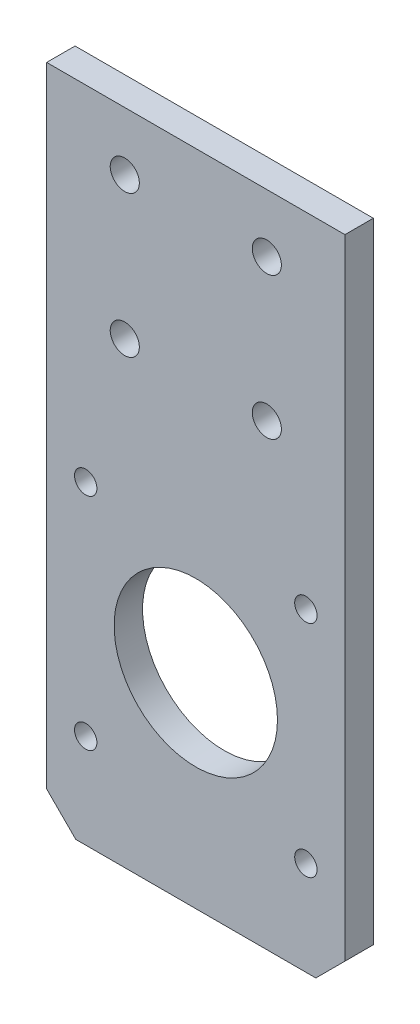
ISO-10303-21;
HEADER;
FILE_DESCRIPTION(('STEP AP214'),'2;1');
FILE_NAME('part.step','',(''),(''),'','','');
FILE_SCHEMA(('AUTOMOTIVE_DESIGN { 1 0 10303 214 1 1 1 1 }'));
ENDSEC;
DATA;
#1=APPLICATION_CONTEXT('core data for automotive mechanical design processes');
#2=APPLICATION_PROTOCOL_DEFINITION('international standard','automotive_design',2000,#1);
#3=PRODUCT_CONTEXT('',#1,'mechanical');
#4=PRODUCT('Part','Part','',(#3));
#5=PRODUCT_RELATED_PRODUCT_CATEGORY('part','',(#4));
#6=PRODUCT_DEFINITION_FORMATION('','',#4);
#7=PRODUCT_DEFINITION_CONTEXT('part definition',#1,'design');
#8=PRODUCT_DEFINITION('design','',#6,#7);
#9=PRODUCT_DEFINITION_SHAPE('','',#8);
#10=(LENGTH_UNIT() NAMED_UNIT(*) SI_UNIT(.MILLI.,.METRE.));
#11=(NAMED_UNIT(*) PLANE_ANGLE_UNIT() SI_UNIT($,.RADIAN.));
#12=(NAMED_UNIT(*) SI_UNIT($,.STERADIAN.) SOLID_ANGLE_UNIT());
#13=UNCERTAINTY_MEASURE_WITH_UNIT(LENGTH_MEASURE(1.E-05),#10,'distance_accuracy_value','');
#14=(GEOMETRIC_REPRESENTATION_CONTEXT(3) GLOBAL_UNCERTAINTY_ASSIGNED_CONTEXT((#13)) GLOBAL_UNIT_ASSIGNED_CONTEXT((#10,
#11,#12)) REPRESENTATION_CONTEXT('',''));
#15=CARTESIAN_POINT('',(0.,0.,0.));
#16=DIRECTION('',(0.,0.,1.));
#17=DIRECTION('',(1.,0.,0.));
#18=AXIS2_PLACEMENT_3D('',#15,#16,#17);
#19=CARTESIAN_POINT('',(0.,0.,4.));
#20=DIRECTION('',(0.,0.,1.));
#21=DIRECTION('',(1.,0.,0.));
#22=AXIS2_PLACEMENT_3D('',#19,#20,#21);
#23=PLANE('',#22);
#24=CARTESIAN_POINT('',(5.50000000000001,5.58,4.));
#25=DIRECTION('',(0.,0.,1.));
#26=DIRECTION('',(1.,0.,0.));
#27=AXIS2_PLACEMENT_3D('',#24,#25,#26);
#28=CIRCLE('',#27,1.575);
#29=CARTESIAN_POINT('',(7.07500000000001,5.58,4.));
#30=VERTEX_POINT('',#29);
#31=EDGE_CURVE('E139',#30,#30,#28,.T.);
#32=ORIENTED_EDGE('',*,*,#31,.F.);
#33=EDGE_LOOP('',(#32));
#34=FACE_BOUND('',#33,.T.);
#35=CARTESIAN_POINT('',(36.5,5.58,4.));
#36=DIRECTION('',(0.,0.,1.));
#37=DIRECTION('',(1.,0.,0.));
#38=AXIS2_PLACEMENT_3D('',#35,#36,#37);
#39=CIRCLE('',#38,1.575);
#40=CARTESIAN_POINT('',(38.075,5.58,4.));
#41=VERTEX_POINT('',#40);
#42=EDGE_CURVE('E180',#41,#41,#39,.T.);
#43=ORIENTED_EDGE('',*,*,#42,.F.);
#44=EDGE_LOOP('',(#43));
#45=FACE_BOUND('',#44,.T.);
#46=CARTESIAN_POINT('',(36.5,36.58,4.));
#47=DIRECTION('',(0.,0.,1.));
#48=DIRECTION('',(1.,0.,0.));
#49=AXIS2_PLACEMENT_3D('',#46,#47,#48);
#50=CIRCLE('',#49,1.575);
#51=CARTESIAN_POINT('',(38.075,36.58,4.));
#52=VERTEX_POINT('',#51);
#53=EDGE_CURVE('E186',#52,#52,#50,.T.);
#54=ORIENTED_EDGE('',*,*,#53,.F.);
#55=EDGE_LOOP('',(#54));
#56=FACE_BOUND('',#55,.T.);
#57=CARTESIAN_POINT('',(5.5,36.58,4.));
#58=DIRECTION('',(0.,0.,1.));
#59=DIRECTION('',(1.,0.,0.));
#60=AXIS2_PLACEMENT_3D('',#57,#58,#59);
#61=CIRCLE('',#60,1.575);
#62=CARTESIAN_POINT('',(7.075,36.58,4.));
#63=VERTEX_POINT('',#62);
#64=EDGE_CURVE('E192',#63,#63,#61,.T.);
#65=ORIENTED_EDGE('',*,*,#64,.F.);
#66=EDGE_LOOP('',(#65));
#67=FACE_BOUND('',#66,.T.);
#68=CARTESIAN_POINT('',(21.,21.08,4.));
#69=DIRECTION('',(0.,0.,1.));
#70=DIRECTION('',(1.,0.,0.));
#71=AXIS2_PLACEMENT_3D('',#68,#69,#70);
#72=CIRCLE('',#71,11.5);
#73=CARTESIAN_POINT('',(32.5,21.08,4.));
#74=VERTEX_POINT('',#73);
#75=EDGE_CURVE('E198',#74,#74,#72,.T.);
#76=ORIENTED_EDGE('',*,*,#75,.F.);
#77=EDGE_LOOP('',(#76));
#78=FACE_BOUND('',#77,.T.);
#79=CARTESIAN_POINT('',(11.,56.8,4.));
#80=DIRECTION('',(0.,0.,1.));
#81=DIRECTION('',(1.,0.,0.));
#82=AXIS2_PLACEMENT_3D('',#79,#80,#81);
#83=CIRCLE('',#82,2.05000000000001);
#84=CARTESIAN_POINT('',(13.05,56.8,4.));
#85=VERTEX_POINT('',#84);
#86=EDGE_CURVE('E207',#85,#85,#83,.T.);
#87=ORIENTED_EDGE('',*,*,#86,.F.);
#88=EDGE_LOOP('',(#87));
#89=FACE_BOUND('',#88,.T.);
#90=CARTESIAN_POINT('',(31.,76.8,4.));
#91=DIRECTION('',(0.,0.,1.));
#92=DIRECTION('',(1.,0.,0.));
#93=AXIS2_PLACEMENT_3D('',#90,#91,#92);
#94=CIRCLE('',#93,2.04999999999999);
#95=CARTESIAN_POINT('',(33.05,76.8,4.));
#96=VERTEX_POINT('',#95);
#97=EDGE_CURVE('E219',#96,#96,#94,.T.);
#98=ORIENTED_EDGE('',*,*,#97,.F.);
#99=EDGE_LOOP('',(#98));
#100=FACE_BOUND('',#99,.T.);
#101=DIRECTION('',(1.,0.,0.));
#102=VECTOR('',#101,1.);
#103=CARTESIAN_POINT('',(0.,-7.7,4.));
#104=LINE('',#103,#102);
#105=CARTESIAN_POINT('',(4.10000000000001,-7.7,4.));
#106=VERTEX_POINT('',#105);
#107=CARTESIAN_POINT('',(37.9,-7.7,4.));
#108=VERTEX_POINT('',#107);
#109=EDGE_CURVE('E140',#106,#108,#104,.T.);
#110=ORIENTED_EDGE('',*,*,#109,.T.);
#111=DIRECTION('',(0.707106781186546,0.707106781186549,0.));
#112=VECTOR('',#111,1.);
#113=CARTESIAN_POINT('',(22.8000000000001,-22.8,4.));
#114=LINE('',#113,#112);
#115=CARTESIAN_POINT('',(42.,-3.59999999999999,4.));
#116=VERTEX_POINT('',#115);
#117=EDGE_CURVE('E95',#108,#116,#114,.T.);
#118=ORIENTED_EDGE('',*,*,#117,.T.);
#119=DIRECTION('',(0.,1.,0.));
#120=VECTOR('',#119,1.);
#121=CARTESIAN_POINT('',(42.,85.,4.));
#122=LINE('',#121,#120);
#123=CARTESIAN_POINT('',(42.,85.,4.));
#124=VERTEX_POINT('',#123);
#125=EDGE_CURVE('E87',#116,#124,#122,.T.);
#126=ORIENTED_EDGE('',*,*,#125,.T.);
#127=DIRECTION('',(-1.,0.,0.));
#128=VECTOR('',#127,1.);
#129=CARTESIAN_POINT('',(0.,85.,4.));
#130=LINE('',#129,#128);
#131=CARTESIAN_POINT('',(0.,85.,4.));
#132=VERTEX_POINT('',#131);
#133=EDGE_CURVE('E93',#124,#132,#130,.T.);
#134=ORIENTED_EDGE('',*,*,#133,.T.);
#135=DIRECTION('',(0.,-1.,0.));
#136=VECTOR('',#135,1.);
#137=CARTESIAN_POINT('',(0.,85.,4.));
#138=LINE('',#137,#136);
#139=CARTESIAN_POINT('',(0.,-3.59999999999998,4.));
#140=VERTEX_POINT('',#139);
#141=EDGE_CURVE('E96',#132,#140,#138,.T.);
#142=ORIENTED_EDGE('',*,*,#141,.T.);
#143=DIRECTION('',(0.707106781186549,-0.707106781186546,0.));
#144=VECTOR('',#143,1.);
#145=CARTESIAN_POINT('',(-1.8,-1.80000000000001,4.));
#146=LINE('',#145,#144);
#147=EDGE_CURVE('E124',#140,#106,#146,.T.);
#148=ORIENTED_EDGE('',*,*,#147,.T.);
#149=EDGE_LOOP('',(#110,#118,#126,#134,#142,#148));
#150=FACE_BOUND('',#149,.T.);
#151=CARTESIAN_POINT('',(11.,76.8,4.));
#152=DIRECTION('',(0.,0.,1.));
#153=DIRECTION('',(1.,0.,0.));
#154=AXIS2_PLACEMENT_3D('',#151,#152,#153);
#155=CIRCLE('',#154,2.04999999999999);
#156=CARTESIAN_POINT('',(13.05,76.8,4.));
#157=VERTEX_POINT('',#156);
#158=EDGE_CURVE('E116',#157,#157,#155,.T.);
#159=ORIENTED_EDGE('',*,*,#158,.F.);
#160=EDGE_LOOP('',(#159));
#161=FACE_BOUND('',#160,.T.);
#162=CARTESIAN_POINT('',(31.,56.8,4.));
#163=DIRECTION('',(0.,0.,1.));
#164=DIRECTION('',(1.,0.,0.));
#165=AXIS2_PLACEMENT_3D('',#162,#163,#164);
#166=CIRCLE('',#165,2.04999999999999);
#167=CARTESIAN_POINT('',(33.05,56.8,4.));
#168=VERTEX_POINT('',#167);
#169=EDGE_CURVE('E213',#168,#168,#166,.T.);
#170=ORIENTED_EDGE('',*,*,#169,.F.);
#171=EDGE_LOOP('',(#170));
#172=FACE_BOUND('',#171,.T.);
#173=ADVANCED_FACE('F33',(#34,#45,#56,#67,#78,#89,#100,#150,#161,#172),#23,.T.);
#174=CARTESIAN_POINT('',(0.,0.,0.));
#175=DIRECTION('',(0.,0.,1.));
#176=DIRECTION('',(1.,0.,0.));
#177=AXIS2_PLACEMENT_3D('',#174,#175,#176);
#178=PLANE('',#177);
#179=CARTESIAN_POINT('',(5.50000000000001,5.58,0.));
#180=DIRECTION('',(0.,0.,1.));
#181=DIRECTION('',(1.,0.,0.));
#182=AXIS2_PLACEMENT_3D('',#179,#180,#181);
#183=CIRCLE('',#182,1.575);
#184=CARTESIAN_POINT('',(7.07500000000001,5.58,0.));
#185=VERTEX_POINT('',#184);
#186=EDGE_CURVE('E177',#185,#185,#183,.T.);
#187=ORIENTED_EDGE('',*,*,#186,.T.);
#188=EDGE_LOOP('',(#187));
#189=FACE_BOUND('',#188,.T.);
#190=CARTESIAN_POINT('',(36.5,5.58,0.));
#191=DIRECTION('',(0.,0.,1.));
#192=DIRECTION('',(1.,0.,0.));
#193=AXIS2_PLACEMENT_3D('',#190,#191,#192);
#194=CIRCLE('',#193,1.575);
#195=CARTESIAN_POINT('',(38.075,5.58,0.));
#196=VERTEX_POINT('',#195);
#197=EDGE_CURVE('E183',#196,#196,#194,.T.);
#198=ORIENTED_EDGE('',*,*,#197,.T.);
#199=EDGE_LOOP('',(#198));
#200=FACE_BOUND('',#199,.T.);
#201=CARTESIAN_POINT('',(36.5,36.58,0.));
#202=DIRECTION('',(0.,0.,1.));
#203=DIRECTION('',(1.,0.,0.));
#204=AXIS2_PLACEMENT_3D('',#201,#202,#203);
#205=CIRCLE('',#204,1.575);
#206=CARTESIAN_POINT('',(38.075,36.58,0.));
#207=VERTEX_POINT('',#206);
#208=EDGE_CURVE('E189',#207,#207,#205,.T.);
#209=ORIENTED_EDGE('',*,*,#208,.T.);
#210=EDGE_LOOP('',(#209));
#211=FACE_BOUND('',#210,.T.);
#212=CARTESIAN_POINT('',(5.5,36.58,0.));
#213=DIRECTION('',(0.,0.,1.));
#214=DIRECTION('',(1.,0.,0.));
#215=AXIS2_PLACEMENT_3D('',#212,#213,#214);
#216=CIRCLE('',#215,1.575);
#217=CARTESIAN_POINT('',(7.075,36.58,0.));
#218=VERTEX_POINT('',#217);
#219=EDGE_CURVE('E195',#218,#218,#216,.T.);
#220=ORIENTED_EDGE('',*,*,#219,.T.);
#221=EDGE_LOOP('',(#220));
#222=FACE_BOUND('',#221,.T.);
#223=CARTESIAN_POINT('',(21.,21.08,0.));
#224=DIRECTION('',(0.,0.,1.));
#225=DIRECTION('',(1.,0.,0.));
#226=AXIS2_PLACEMENT_3D('',#223,#224,#225);
#227=CIRCLE('',#226,11.5);
#228=CARTESIAN_POINT('',(32.5,21.08,0.));
#229=VERTEX_POINT('',#228);
#230=EDGE_CURVE('E201',#229,#229,#227,.T.);
#231=ORIENTED_EDGE('',*,*,#230,.T.);
#232=EDGE_LOOP('',(#231));
#233=FACE_BOUND('',#232,.T.);
#234=DIRECTION('',(0.,1.,0.));
#235=VECTOR('',#234,1.);
#236=CARTESIAN_POINT('',(42.,85.,0.));
#237=LINE('',#236,#235);
#238=CARTESIAN_POINT('',(42.,-3.59999999999996,0.));
#239=VERTEX_POINT('',#238);
#240=CARTESIAN_POINT('',(42.,85.,0.));
#241=VERTEX_POINT('',#240);
#242=EDGE_CURVE('E101',#239,#241,#237,.T.);
#243=ORIENTED_EDGE('',*,*,#242,.F.);
#244=DIRECTION('',(-0.707106781186546,-0.707106781186549,0.));
#245=VECTOR('',#244,1.);
#246=CARTESIAN_POINT('',(37.9,-7.7,0.));
#247=LINE('',#246,#245);
#248=CARTESIAN_POINT('',(37.9,-7.7,0.));
#249=VERTEX_POINT('',#248);
#250=EDGE_CURVE('E41',#239,#249,#247,.T.);
#251=ORIENTED_EDGE('',*,*,#250,.T.);
#252=DIRECTION('',(1.,0.,0.));
#253=VECTOR('',#252,1.);
#254=CARTESIAN_POINT('',(0.,-7.7,0.));
#255=LINE('',#254,#253);
#256=CARTESIAN_POINT('',(4.10000000000001,-7.7,0.));
#257=VERTEX_POINT('',#256);
#258=EDGE_CURVE('E132',#257,#249,#255,.T.);
#259=ORIENTED_EDGE('',*,*,#258,.F.);
#260=DIRECTION('',(-0.707106781186549,0.707106781186546,0.));
#261=VECTOR('',#260,1.);
#262=CARTESIAN_POINT('',(0.,-3.60000000000001,0.));
#263=LINE('',#262,#261);
#264=CARTESIAN_POINT('',(0.,-3.59999999999998,0.));
#265=VERTEX_POINT('',#264);
#266=EDGE_CURVE('E48',#257,#265,#263,.T.);
#267=ORIENTED_EDGE('',*,*,#266,.T.);
#268=DIRECTION('',(0.,-1.,0.));
#269=VECTOR('',#268,1.);
#270=CARTESIAN_POINT('',(0.,85.,0.));
#271=LINE('',#270,#269);
#272=CARTESIAN_POINT('',(0.,85.,0.));
#273=VERTEX_POINT('',#272);
#274=EDGE_CURVE('E114',#273,#265,#271,.T.);
#275=ORIENTED_EDGE('',*,*,#274,.F.);
#276=DIRECTION('',(-1.,0.,0.));
#277=VECTOR('',#276,1.);
#278=CARTESIAN_POINT('',(0.,85.,0.));
#279=LINE('',#278,#277);
#280=EDGE_CURVE('E118',#241,#273,#279,.T.);
#281=ORIENTED_EDGE('',*,*,#280,.F.);
#282=EDGE_LOOP('',(#243,#251,#259,#267,#275,#281));
#283=FACE_BOUND('',#282,.T.);
#284=CARTESIAN_POINT('',(11.,76.8,0.));
#285=DIRECTION('',(0.,0.,1.));
#286=DIRECTION('',(1.,0.,0.));
#287=AXIS2_PLACEMENT_3D('',#284,#285,#286);
#288=CIRCLE('',#287,2.04999999999999);
#289=CARTESIAN_POINT('',(13.05,76.8,0.));
#290=VERTEX_POINT('',#289);
#291=EDGE_CURVE('E222',#290,#290,#288,.T.);
#292=ORIENTED_EDGE('',*,*,#291,.T.);
#293=EDGE_LOOP('',(#292));
#294=FACE_BOUND('',#293,.T.);
#295=CARTESIAN_POINT('',(31.,76.8,0.));
#296=DIRECTION('',(0.,0.,1.));
#297=DIRECTION('',(1.,0.,0.));
#298=AXIS2_PLACEMENT_3D('',#295,#296,#297);
#299=CIRCLE('',#298,2.04999999999999);
#300=CARTESIAN_POINT('',(33.05,76.8,0.));
#301=VERTEX_POINT('',#300);
#302=EDGE_CURVE('E216',#301,#301,#299,.T.);
#303=ORIENTED_EDGE('',*,*,#302,.T.);
#304=EDGE_LOOP('',(#303));
#305=FACE_BOUND('',#304,.T.);
#306=CARTESIAN_POINT('',(31.,56.8,0.));
#307=DIRECTION('',(0.,0.,1.));
#308=DIRECTION('',(1.,0.,0.));
#309=AXIS2_PLACEMENT_3D('',#306,#307,#308);
#310=CIRCLE('',#309,2.04999999999999);
#311=CARTESIAN_POINT('',(33.05,56.8,0.));
#312=VERTEX_POINT('',#311);
#313=EDGE_CURVE('E210',#312,#312,#310,.T.);
#314=ORIENTED_EDGE('',*,*,#313,.T.);
#315=EDGE_LOOP('',(#314));
#316=FACE_BOUND('',#315,.T.);
#317=CARTESIAN_POINT('',(11.,56.8,0.));
#318=DIRECTION('',(0.,0.,1.));
#319=DIRECTION('',(1.,0.,0.));
#320=AXIS2_PLACEMENT_3D('',#317,#318,#319);
#321=CIRCLE('',#320,2.05000000000001);
#322=CARTESIAN_POINT('',(13.05,56.8,0.));
#323=VERTEX_POINT('',#322);
#324=EDGE_CURVE('E204',#323,#323,#321,.T.);
#325=ORIENTED_EDGE('',*,*,#324,.T.);
#326=EDGE_LOOP('',(#325));
#327=FACE_BOUND('',#326,.T.);
#328=ADVANCED_FACE('F130',(#189,#200,#211,#222,#233,#283,#294,#305,#316,#327),#178,.F.);
#329=CARTESIAN_POINT('',(0.,85.,4.));
#330=DIRECTION('',(1.,0.,0.));
#331=DIRECTION('',(0.,1.,0.));
#332=AXIS2_PLACEMENT_3D('',#329,#330,#331);
#333=PLANE('',#332);
#334=ORIENTED_EDGE('',*,*,#274,.T.);
#335=DIRECTION('',(0.,0.,1.));
#336=VECTOR('',#335,1.);
#337=CARTESIAN_POINT('',(0.,-3.60000000000001,4.));
#338=LINE('',#337,#336);
#339=EDGE_CURVE('E11',#265,#140,#338,.T.);
#340=ORIENTED_EDGE('',*,*,#339,.T.);
#341=ORIENTED_EDGE('',*,*,#141,.F.);
#342=DIRECTION('',(0.,0.,-1.));
#343=VECTOR('',#342,1.);
#344=CARTESIAN_POINT('',(0.,85.,4.));
#345=LINE('',#344,#343);
#346=EDGE_CURVE('E105',#132,#273,#345,.T.);
#347=ORIENTED_EDGE('',*,*,#346,.T.);
#348=EDGE_LOOP('',(#334,#340,#341,#347));
#349=FACE_BOUND('',#348,.T.);
#350=ADVANCED_FACE('F158',(#349),#333,.F.);
#351=CARTESIAN_POINT('',(42.,85.,4.));
#352=DIRECTION('',(-1.,0.,0.));
#353=DIRECTION('',(0.,0.,1.));
#354=AXIS2_PLACEMENT_3D('',#351,#352,#353);
#355=PLANE('',#354);
#356=ORIENTED_EDGE('',*,*,#125,.F.);
#357=DIRECTION('',(0.,0.,-1.));
#358=VECTOR('',#357,1.);
#359=CARTESIAN_POINT('',(42.,-3.59999999999999,0.));
#360=LINE('',#359,#358);
#361=EDGE_CURVE('E56',#116,#239,#360,.T.);
#362=ORIENTED_EDGE('',*,*,#361,.T.);
#363=ORIENTED_EDGE('',*,*,#242,.T.);
#364=DIRECTION('',(0.,0.,-1.));
#365=VECTOR('',#364,1.);
#366=CARTESIAN_POINT('',(42.,85.,4.));
#367=LINE('',#366,#365);
#368=EDGE_CURVE('E99',#124,#241,#367,.T.);
#369=ORIENTED_EDGE('',*,*,#368,.F.);
#370=EDGE_LOOP('',(#356,#362,#363,#369));
#371=FACE_BOUND('',#370,.T.);
#372=ADVANCED_FACE('F100',(#371),#355,.F.);
#373=CARTESIAN_POINT('',(0.,85.,4.));
#374=DIRECTION('',(0.,-1.,0.));
#375=DIRECTION('',(0.,0.,-1.));
#376=AXIS2_PLACEMENT_3D('',#373,#374,#375);
#377=PLANE('',#376);
#378=ORIENTED_EDGE('',*,*,#280,.T.);
#379=ORIENTED_EDGE('',*,*,#346,.F.);
#380=ORIENTED_EDGE('',*,*,#133,.F.);
#381=ORIENTED_EDGE('',*,*,#368,.T.);
#382=EDGE_LOOP('',(#378,#379,#380,#381));
#383=FACE_BOUND('',#382,.T.);
#384=ADVANCED_FACE('F107',(#383),#377,.F.);
#385=CARTESIAN_POINT('',(11.,76.8,4.));
#386=DIRECTION('',(0.,0.,-1.));
#387=DIRECTION('',(-1.,0.,0.));
#388=AXIS2_PLACEMENT_3D('',#385,#386,#387);
#389=CYLINDRICAL_SURFACE('',#388,2.04999999999999);
#390=ORIENTED_EDGE('',*,*,#158,.T.);
#391=EDGE_LOOP('',(#390));
#392=FACE_BOUND('',#391,.T.);
#393=ORIENTED_EDGE('',*,*,#291,.F.);
#394=EDGE_LOOP('',(#393));
#395=FACE_BOUND('',#394,.T.);
#396=ADVANCED_FACE('F164',(#392,#395),#389,.F.);
#397=CARTESIAN_POINT('',(31.,76.8,4.));
#398=DIRECTION('',(0.,0.,-1.));
#399=DIRECTION('',(-1.,0.,0.));
#400=AXIS2_PLACEMENT_3D('',#397,#398,#399);
#401=CYLINDRICAL_SURFACE('',#400,2.04999999999999);
#402=ORIENTED_EDGE('',*,*,#97,.T.);
#403=EDGE_LOOP('',(#402));
#404=FACE_BOUND('',#403,.T.);
#405=ORIENTED_EDGE('',*,*,#302,.F.);
#406=EDGE_LOOP('',(#405));
#407=FACE_BOUND('',#406,.T.);
#408=ADVANCED_FACE('F232',(#404,#407),#401,.F.);
#409=CARTESIAN_POINT('',(31.,56.8,4.));
#410=DIRECTION('',(0.,0.,-1.));
#411=DIRECTION('',(-1.,0.,0.));
#412=AXIS2_PLACEMENT_3D('',#409,#410,#411);
#413=CYLINDRICAL_SURFACE('',#412,2.04999999999999);
#414=ORIENTED_EDGE('',*,*,#169,.T.);
#415=EDGE_LOOP('',(#414));
#416=FACE_BOUND('',#415,.T.);
#417=ORIENTED_EDGE('',*,*,#313,.F.);
#418=EDGE_LOOP('',(#417));
#419=FACE_BOUND('',#418,.T.);
#420=ADVANCED_FACE('F237',(#416,#419),#413,.F.);
#421=CARTESIAN_POINT('',(11.,56.8,4.));
#422=DIRECTION('',(0.,0.,-1.));
#423=DIRECTION('',(-1.,0.,0.));
#424=AXIS2_PLACEMENT_3D('',#421,#422,#423);
#425=CYLINDRICAL_SURFACE('',#424,2.05000000000001);
#426=ORIENTED_EDGE('',*,*,#86,.T.);
#427=EDGE_LOOP('',(#426));
#428=FACE_BOUND('',#427,.T.);
#429=ORIENTED_EDGE('',*,*,#324,.F.);
#430=EDGE_LOOP('',(#429));
#431=FACE_BOUND('',#430,.T.);
#432=ADVANCED_FACE('F245',(#428,#431),#425,.F.);
#433=CARTESIAN_POINT('',(21.,21.08,0.));
#434=DIRECTION('',(0.,0.,1.));
#435=DIRECTION('',(1.,0.,0.));
#436=AXIS2_PLACEMENT_3D('',#433,#434,#435);
#437=CYLINDRICAL_SURFACE('',#436,11.5);
#438=ORIENTED_EDGE('',*,*,#230,.F.);
#439=EDGE_LOOP('',(#438));
#440=FACE_BOUND('',#439,.T.);
#441=ORIENTED_EDGE('',*,*,#75,.T.);
#442=EDGE_LOOP('',(#441));
#443=FACE_BOUND('',#442,.T.);
#444=ADVANCED_FACE('F253',(#440,#443),#437,.F.);
#445=CARTESIAN_POINT('',(5.5,36.58,0.));
#446=DIRECTION('',(0.,0.,1.));
#447=DIRECTION('',(1.,0.,0.));
#448=AXIS2_PLACEMENT_3D('',#445,#446,#447);
#449=CYLINDRICAL_SURFACE('',#448,1.575);
#450=ORIENTED_EDGE('',*,*,#219,.F.);
#451=EDGE_LOOP('',(#450));
#452=FACE_BOUND('',#451,.T.);
#453=ORIENTED_EDGE('',*,*,#64,.T.);
#454=EDGE_LOOP('',(#453));
#455=FACE_BOUND('',#454,.T.);
#456=ADVANCED_FACE('F259',(#452,#455),#449,.F.);
#457=CARTESIAN_POINT('',(36.5,36.58,0.));
#458=DIRECTION('',(0.,0.,1.));
#459=DIRECTION('',(1.,0.,0.));
#460=AXIS2_PLACEMENT_3D('',#457,#458,#459);
#461=CYLINDRICAL_SURFACE('',#460,1.575);
#462=ORIENTED_EDGE('',*,*,#208,.F.);
#463=EDGE_LOOP('',(#462));
#464=FACE_BOUND('',#463,.T.);
#465=ORIENTED_EDGE('',*,*,#53,.T.);
#466=EDGE_LOOP('',(#465));
#467=FACE_BOUND('',#466,.T.);
#468=ADVANCED_FACE('F265',(#464,#467),#461,.F.);
#469=CARTESIAN_POINT('',(36.5,5.58,0.));
#470=DIRECTION('',(0.,0.,1.));
#471=DIRECTION('',(1.,0.,0.));
#472=AXIS2_PLACEMENT_3D('',#469,#470,#471);
#473=CYLINDRICAL_SURFACE('',#472,1.575);
#474=ORIENTED_EDGE('',*,*,#197,.F.);
#475=EDGE_LOOP('',(#474));
#476=FACE_BOUND('',#475,.T.);
#477=ORIENTED_EDGE('',*,*,#42,.T.);
#478=EDGE_LOOP('',(#477));
#479=FACE_BOUND('',#478,.T.);
#480=ADVANCED_FACE('F269',(#476,#479),#473,.F.);
#481=CARTESIAN_POINT('',(5.50000000000001,5.58,0.));
#482=DIRECTION('',(0.,0.,1.));
#483=DIRECTION('',(1.,0.,0.));
#484=AXIS2_PLACEMENT_3D('',#481,#482,#483);
#485=CYLINDRICAL_SURFACE('',#484,1.575);
#486=ORIENTED_EDGE('',*,*,#186,.F.);
#487=EDGE_LOOP('',(#486));
#488=FACE_BOUND('',#487,.T.);
#489=ORIENTED_EDGE('',*,*,#31,.T.);
#490=EDGE_LOOP('',(#489));
#491=FACE_BOUND('',#490,.T.);
#492=ADVANCED_FACE('F149',(#488,#491),#485,.F.);
#493=CARTESIAN_POINT('',(0.,-7.7,0.));
#494=DIRECTION('',(0.,-1.,0.));
#495=DIRECTION('',(0.,0.,-1.));
#496=AXIS2_PLACEMENT_3D('',#493,#494,#495);
#497=PLANE('',#496);
#498=ORIENTED_EDGE('',*,*,#258,.T.);
#499=DIRECTION('',(0.,0.,1.));
#500=VECTOR('',#499,1.);
#501=CARTESIAN_POINT('',(37.9,-7.7,4.));
#502=LINE('',#501,#500);
#503=EDGE_CURVE('E121',#249,#108,#502,.T.);
#504=ORIENTED_EDGE('',*,*,#503,.T.);
#505=ORIENTED_EDGE('',*,*,#109,.F.);
#506=DIRECTION('',(0.,0.,-1.));
#507=VECTOR('',#506,1.);
#508=CARTESIAN_POINT('',(4.10000000000001,-7.7,0.));
#509=LINE('',#508,#507);
#510=EDGE_CURVE('E104',#106,#257,#509,.T.);
#511=ORIENTED_EDGE('',*,*,#510,.T.);
#512=EDGE_LOOP('',(#498,#504,#505,#511));
#513=FACE_BOUND('',#512,.T.);
#514=ADVANCED_FACE('F136',(#513),#497,.T.);
#515=CARTESIAN_POINT('',(37.9,-7.7,0.));
#516=DIRECTION('',(0.707106781186549,-0.707106781186546,0.));
#517=DIRECTION('',(0.,0.,-1.));
#518=AXIS2_PLACEMENT_3D('',#515,#516,#517);
#519=PLANE('',#518);
#520=ORIENTED_EDGE('',*,*,#250,.F.);
#521=ORIENTED_EDGE('',*,*,#361,.F.);
#522=ORIENTED_EDGE('',*,*,#117,.F.);
#523=ORIENTED_EDGE('',*,*,#503,.F.);
#524=EDGE_LOOP('',(#520,#521,#522,#523));
#525=FACE_BOUND('',#524,.T.);
#526=ADVANCED_FACE('F142',(#525),#519,.T.);
#527=CARTESIAN_POINT('',(0.,-3.60000000000001,4.));
#528=DIRECTION('',(-0.707106781186546,-0.707106781186549,0.));
#529=DIRECTION('',(0.,0.,-1.));
#530=AXIS2_PLACEMENT_3D('',#527,#528,#529);
#531=PLANE('',#530);
#532=ORIENTED_EDGE('',*,*,#266,.F.);
#533=ORIENTED_EDGE('',*,*,#510,.F.);
#534=ORIENTED_EDGE('',*,*,#147,.F.);
#535=ORIENTED_EDGE('',*,*,#339,.F.);
#536=EDGE_LOOP('',(#532,#533,#534,#535));
#537=FACE_BOUND('',#536,.T.);
#538=ADVANCED_FACE('F35',(#537),#531,.T.);
#539=CLOSED_SHELL('',(#173,#328,#350,#372,#384,#396,#408,#420,#432,#444,#456,#468,#480,#492,
#514,#526,#538));
#540=MANIFOLD_SOLID_BREP('B2',#539);
#541=ADVANCED_BREP_SHAPE_REPRESENTATION('',(#18,#540),#14);
#542=SHAPE_DEFINITION_REPRESENTATION(#9,#541);
ENDSEC;
END-ISO-10303-21;
